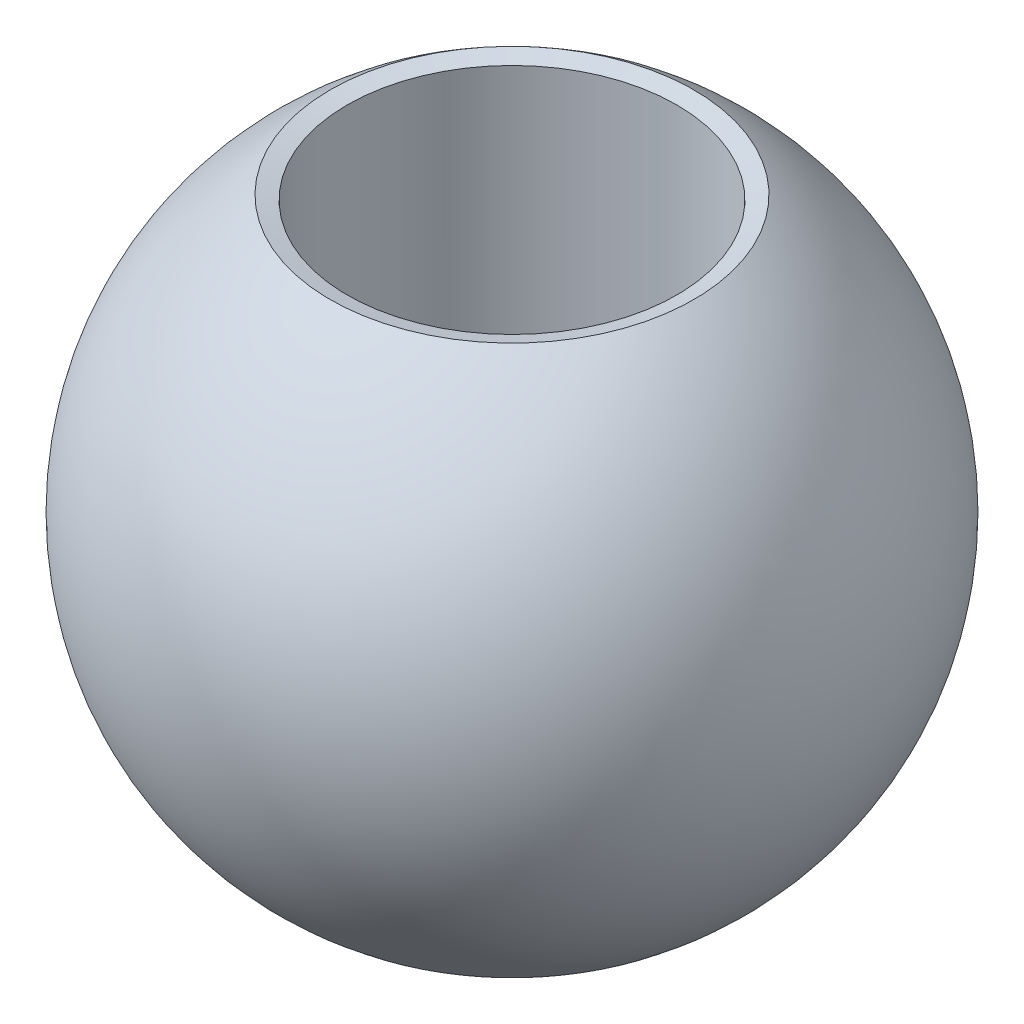
ISO-10303-21;
HEADER;
FILE_DESCRIPTION(('STEP AP214'),'2;1');
FILE_NAME('part.step','',(''),(''),'','','');
FILE_SCHEMA(('AUTOMOTIVE_DESIGN { 1 0 10303 214 1 1 1 1 }'));
ENDSEC;
DATA;
#1=APPLICATION_CONTEXT('core data for automotive mechanical design processes');
#2=APPLICATION_PROTOCOL_DEFINITION('international standard','automotive_design',2000,#1);
#3=PRODUCT_CONTEXT('',#1,'mechanical');
#4=PRODUCT('Part','Part','',(#3));
#5=PRODUCT_RELATED_PRODUCT_CATEGORY('part','',(#4));
#6=PRODUCT_DEFINITION_FORMATION('','',#4);
#7=PRODUCT_DEFINITION_CONTEXT('part definition',#1,'design');
#8=PRODUCT_DEFINITION('design','',#6,#7);
#9=PRODUCT_DEFINITION_SHAPE('','',#8);
#10=(LENGTH_UNIT() NAMED_UNIT(*) SI_UNIT(.MILLI.,.METRE.));
#11=(NAMED_UNIT(*) PLANE_ANGLE_UNIT() SI_UNIT($,.RADIAN.));
#12=(NAMED_UNIT(*) SI_UNIT($,.STERADIAN.) SOLID_ANGLE_UNIT());
#13=UNCERTAINTY_MEASURE_WITH_UNIT(LENGTH_MEASURE(1.E-05),#10,'distance_accuracy_value','');
#14=(GEOMETRIC_REPRESENTATION_CONTEXT(3) GLOBAL_UNCERTAINTY_ASSIGNED_CONTEXT((#13)) GLOBAL_UNIT_ASSIGNED_CONTEXT((#10,
#11,#12)) REPRESENTATION_CONTEXT('',''));
#15=CARTESIAN_POINT('',(0.,0.,0.));
#16=DIRECTION('',(0.,0.,1.));
#17=DIRECTION('',(1.,0.,0.));
#18=AXIS2_PLACEMENT_3D('',#15,#16,#17);
#19=CARTESIAN_POINT('',(0.,0.,0.));
#20=DIRECTION('',(0.,-1.,0.));
#21=DIRECTION('',(-1.,0.,0.));
#22=AXIS2_PLACEMENT_3D('',#19,#20,#21);
#23=SPHERICAL_SURFACE('',#22,8.);
#24=CARTESIAN_POINT('',(0.,-6.67281115870977,0.));
#25=DIRECTION('',(0.,1.,0.));
#26=DIRECTION('',(0.,0.,1.));
#27=AXIS2_PLACEMENT_3D('',#24,#25,#26);
#28=CIRCLE('',#27,4.41288921685083);
#29=CARTESIAN_POINT('',(-4.41288921685083,-6.67281115870977,0.));
#30=VERTEX_POINT('',#29);
#31=EDGE_CURVE('E12',#30,#30,#28,.T.);
#32=CARTESIAN_POINT('',(0.,6.67281115870977,0.));
#33=DIRECTION('',(0.,-1.,0.));
#34=DIRECTION('',(0.,0.,-1.));
#35=AXIS2_PLACEMENT_3D('',#32,#33,#34);
#36=CIRCLE('',#35,4.41288921685084);
#37=CARTESIAN_POINT('',(-4.41288921685084,6.67281115870977,0.));
#38=VERTEX_POINT('',#37);
#39=EDGE_CURVE('E53',#38,#38,#36,.T.);
#40=CARTESIAN_POINT('',(-4.41288921685083,-6.67281115870977,0.));
#41=CARTESIAN_POINT('',(-4.55003378097676,-6.58212246670938,0.));
#42=CARTESIAN_POINT('',(-4.68437430688309,-6.48719507561175,0.));
#43=CARTESIAN_POINT('',(-4.94695503157561,-6.28924790254711,0.));
#44=CARTESIAN_POINT('',(-5.0751952303618,-6.18622812058009,0.));
#45=CARTESIAN_POINT('',(-5.32508305013311,-5.97248117310178,0.));
#46=CARTESIAN_POINT('',(-5.44673067111824,-5.86175400759048,0.));
#47=CARTESIAN_POINT('',(-5.68297235028429,-5.63301483111974,0.));
#48=CARTESIAN_POINT('',(-5.79756640846523,-5.5150028201603,0.));
#49=CARTESIAN_POINT('',(-6.01926511821973,-5.27214196749989,0.));
#50=CARTESIAN_POINT('',(-6.12636976979331,-5.14729312579892,0.));
#51=CARTESIAN_POINT('',(-6.33268273053243,-4.89123320001838,0.));
#52=CARTESIAN_POINT('',(-6.43189103969798,-4.7600221159388,0.));
#53=CARTESIAN_POINT('',(-6.62203426880473,-4.49173631368054,0.));
#54=CARTESIAN_POINT('',(-6.71296918874592,-4.35466159550184,0.));
#55=CARTESIAN_POINT('',(-6.88622006598835,-4.07516945938412,0.));
#56=CARTESIAN_POINT('',(-6.96853602328959,-3.9327520414451,0.));
#57=CARTESIAN_POINT('',(-7.12423614791978,-3.64311573263774,0.));
#58=CARTESIAN_POINT('',(-7.19762031524874,-3.4958968417694,0.));
#59=CARTESIAN_POINT('',(-7.33517797840274,-3.19721706403265,0.));
#60=CARTESIAN_POINT('',(-7.39935147422778,-3.04575617716423,0.));
#61=CARTESIAN_POINT('',(-7.51824391556208,-2.73916800440638,0.));
#62=CARTESIAN_POINT('',(-7.57296286107135,-2.58404071851694,0.));
#63=CARTESIAN_POINT('',(-7.67273825327632,-2.27070927833958,0.));
#64=CARTESIAN_POINT('',(-7.71779469997201,-2.11250512405166,0.));
#65=CARTESIAN_POINT('',(-7.79807386642397,-1.79362117067116,0.));
#66=CARTESIAN_POINT('',(-7.83329658618023,-1.63294137157858,0.));
#67=CARTESIAN_POINT('',(-7.89377444177405,-1.30971676039685,0.));
#68=CARTESIAN_POINT('',(-7.91902957761163,-1.14717194830771,0.));
#69=CARTESIAN_POINT('',(-7.95947628821743,-0.820835030549872,0.));
#70=CARTESIAN_POINT('',(-7.97466786298567,-0.657042924881178,0.));
#71=CARTESIAN_POINT('',(-7.99492971887695,-0.32883387947499,0.));
#72=CARTESIAN_POINT('',(-8.,-0.164416939737497,0.));
#73=CARTESIAN_POINT('',(-8.,0.16441693973749,0.));
#74=CARTESIAN_POINT('',(-7.99492971887695,0.328833879474984,0.));
#75=CARTESIAN_POINT('',(-7.97466786298567,0.657042924881171,0.));
#76=CARTESIAN_POINT('',(-7.95947628821743,0.820835030549866,0.));
#77=CARTESIAN_POINT('',(-7.91902957761163,1.1471719483077,0.));
#78=CARTESIAN_POINT('',(-7.89377444177405,1.30971676039685,0.));
#79=CARTESIAN_POINT('',(-7.83329658618023,1.63294137157857,0.));
#80=CARTESIAN_POINT('',(-7.79807386642397,1.79362117067116,0.));
#81=CARTESIAN_POINT('',(-7.71779469997202,2.11250512405166,0.));
#82=CARTESIAN_POINT('',(-7.67273825327632,2.27070927833958,0.));
#83=CARTESIAN_POINT('',(-7.57296286107135,2.58404071851693,0.));
#84=CARTESIAN_POINT('',(-7.51824391556209,2.73916800440637,0.));
#85=CARTESIAN_POINT('',(-7.39935147422778,3.04575617716422,0.));
#86=CARTESIAN_POINT('',(-7.33517797840274,3.19721706403264,0.));
#87=CARTESIAN_POINT('',(-7.19762031524874,3.49589684176939,0.));
#88=CARTESIAN_POINT('',(-7.12423614791978,3.64311573263773,0.));
#89=CARTESIAN_POINT('',(-6.96853602328959,3.93275204144509,0.));
#90=CARTESIAN_POINT('',(-6.88622006598836,4.07516945938412,0.));
#91=CARTESIAN_POINT('',(-6.71296918874592,4.35466159550184,0.));
#92=CARTESIAN_POINT('',(-6.62203426880473,4.49173631368053,0.));
#93=CARTESIAN_POINT('',(-6.43189103969798,4.7600221159388,0.));
#94=CARTESIAN_POINT('',(-6.33268273053243,4.89123320001837,0.));
#95=CARTESIAN_POINT('',(-6.12636976979331,5.14729312579892,0.));
#96=CARTESIAN_POINT('',(-6.01926511821974,5.27214196749989,0.));
#97=CARTESIAN_POINT('',(-5.79756640846523,5.51500282016029,0.));
#98=CARTESIAN_POINT('',(-5.6829723502843,5.63301483111973,0.));
#99=CARTESIAN_POINT('',(-5.44673067111824,5.86175400759047,0.));
#100=CARTESIAN_POINT('',(-5.32508305013312,5.97248117310177,0.));
#101=CARTESIAN_POINT('',(-5.0751952303618,6.18622812058009,0.));
#102=CARTESIAN_POINT('',(-4.94695503157562,6.2892479025471,0.));
#103=CARTESIAN_POINT('',(-4.6843743068831,6.48719507561175,0.));
#104=CARTESIAN_POINT('',(-4.55003378097677,6.58212246670938,0.));
#105=CARTESIAN_POINT('',(-4.41288921685084,6.67281115870977,0.));
#106=B_SPLINE_CURVE_WITH_KNOTS('',3,(#40,#41,#42,#43,#44,#45,#46,#47,#48,#49,#50,#51,#52,#53,
#54,#55,#56,#57,#58,#59,#60,#61,#62,#63,#64,#65,#66,#67,#68,#69,#70,#71,#72,#73,#74,#75,#76,#77,
#78,#79,#80,#81,#82,#83,#84,#85,#86,#87,#88,#89,#90,#91,#92,#93,#94,#95,#96,#97,#98,#99,#100,
#101,#102,#103,#104,#105),.UNSPECIFIED.,.F.,.F.,(4,2,2,2,2,2,2,2,2,2,2,2,2,2,2,2,2,2,2,2,2,2,2,
2,2,2,2,2,2,2,2,2,4),(0.,0.493172733531599,0.986345467063197,1.4795182005948,1.9726909341264,
2.46586366765799,2.95903640118959,3.45220913472119,3.94538186825279,4.43855460178439,
4.93172733531599,5.42490006884759,5.91807280237919,6.41124553591079,6.90441826944238,
7.39759100297398,7.89076373650558,8.38393647003718,8.87710920356878,9.37028193710038,
9.86345467063198,10.3566274041636,10.8498001376952,11.3429728712268,11.8361456047584,
12.32931833829,12.8224910718216,13.3156638053532,13.8088365388848,14.3020092724164,
14.795182005948,15.2883547394796,15.7815274730112),.UNSPECIFIED.);
#107=EDGE_CURVE('BSEAM46',#30,#38,#106,.T.);
#108=ORIENTED_EDGE('',*,*,#31,.T.);
#109=ORIENTED_EDGE('',*,*,#39,.T.);
#110=ORIENTED_EDGE('',*,*,#107,.T.);
#111=ORIENTED_EDGE('',*,*,#107,.F.);
#112=EDGE_LOOP('',(#108,#110,#109,#111));
#113=FACE_BOUND('',#112,.T.);
#114=ADVANCED_FACE('F46',(#113),#23,.T.);
#115=CARTESIAN_POINT('',(0.,10.,0.));
#116=DIRECTION('',(0.,-1.,0.));
#117=DIRECTION('',(0.,0.,-1.));
#118=AXIS2_PLACEMENT_3D('',#115,#116,#117);
#119=CYLINDRICAL_SURFACE('',#118,4.);
#120=CARTESIAN_POINT('',(0.,-6.56217782649107,0.));
#121=DIRECTION('',(0.,1.,0.));
#122=DIRECTION('',(0.,0.,1.));
#123=AXIS2_PLACEMENT_3D('',#120,#121,#122);
#124=CIRCLE('',#123,4.);
#125=CARTESIAN_POINT('',(0.,-6.56217782649107,4.));
#126=VERTEX_POINT('',#125);
#127=EDGE_CURVE('E57',#126,#126,#124,.F.);
#128=ORIENTED_EDGE('',*,*,#127,.T.);
#129=EDGE_LOOP('',(#128));
#130=FACE_BOUND('',#129,.T.);
#131=CARTESIAN_POINT('',(0.,6.56217782649107,0.));
#132=DIRECTION('',(0.,-1.,0.));
#133=DIRECTION('',(0.,0.,-1.));
#134=AXIS2_PLACEMENT_3D('',#131,#132,#133);
#135=CIRCLE('',#134,4.);
#136=CARTESIAN_POINT('',(0.,6.56217782649107,-4.));
#137=VERTEX_POINT('',#136);
#138=EDGE_CURVE('E61',#137,#137,#135,.F.);
#139=ORIENTED_EDGE('',*,*,#138,.T.);
#140=EDGE_LOOP('',(#139));
#141=FACE_BOUND('',#140,.T.);
#142=ADVANCED_FACE('F67',(#130,#141),#119,.F.);
#143=CARTESIAN_POINT('',(0.,-6.56217782649107,0.));
#144=DIRECTION('',(0.,-1.,0.));
#145=DIRECTION('',(0.,0.,-1.));
#146=AXIS2_PLACEMENT_3D('',#143,#144,#145);
#147=CONICAL_SURFACE('',#146,4.,1.30899693899575);
#148=ORIENTED_EDGE('',*,*,#31,.F.);
#149=EDGE_LOOP('',(#148));
#150=FACE_BOUND('',#149,.T.);
#151=ORIENTED_EDGE('',*,*,#127,.F.);
#152=EDGE_LOOP('',(#151));
#153=FACE_BOUND('',#152,.T.);
#154=ADVANCED_FACE('F70',(#150,#153),#147,.F.);
#155=CARTESIAN_POINT('',(0.,6.56217782649107,0.));
#156=DIRECTION('',(0.,1.,0.));
#157=DIRECTION('',(0.,0.,1.));
#158=AXIS2_PLACEMENT_3D('',#155,#156,#157);
#159=CONICAL_SURFACE('',#158,4.,1.30899693899576);
#160=ORIENTED_EDGE('',*,*,#39,.F.);
#161=EDGE_LOOP('',(#160));
#162=FACE_BOUND('',#161,.T.);
#163=ORIENTED_EDGE('',*,*,#138,.F.);
#164=EDGE_LOOP('',(#163));
#165=FACE_BOUND('',#164,.T.);
#166=ADVANCED_FACE('F48',(#162,#165),#159,.F.);
#167=CLOSED_SHELL('',(#114,#142,#154,#166));
#168=MANIFOLD_SOLID_BREP('B2',#167);
#169=ADVANCED_BREP_SHAPE_REPRESENTATION('',(#18,#168),#14);
#170=SHAPE_DEFINITION_REPRESENTATION(#9,#169);
ENDSEC;
END-ISO-10303-21;
